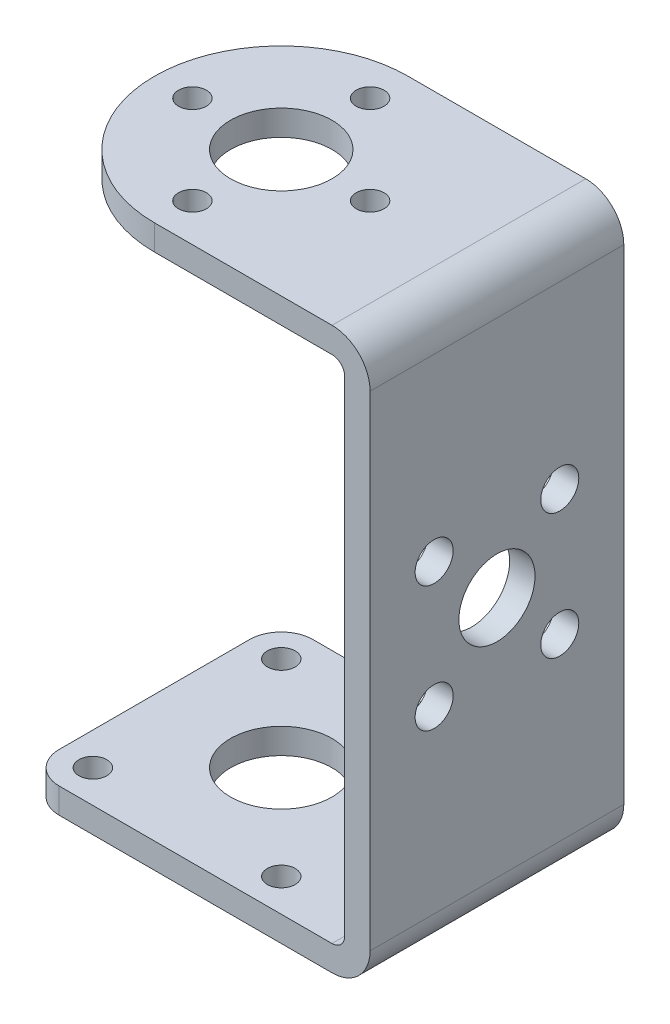
ISO-10303-21;
HEADER;
FILE_DESCRIPTION(('STEP AP214'),'2;1');
FILE_NAME('part.step','',(''),(''),'','','');
FILE_SCHEMA(('AUTOMOTIVE_DESIGN { 1 0 10303 214 1 1 1 1 }'));
ENDSEC;
DATA;
#1=APPLICATION_CONTEXT('core data for automotive mechanical design processes');
#2=APPLICATION_PROTOCOL_DEFINITION('international standard','automotive_design',2000,#1);
#3=PRODUCT_CONTEXT('',#1,'mechanical');
#4=PRODUCT('Part','Part','',(#3));
#5=PRODUCT_RELATED_PRODUCT_CATEGORY('part','',(#4));
#6=PRODUCT_DEFINITION_FORMATION('','',#4);
#7=PRODUCT_DEFINITION_CONTEXT('part definition',#1,'design');
#8=PRODUCT_DEFINITION('design','',#6,#7);
#9=PRODUCT_DEFINITION_SHAPE('','',#8);
#10=(LENGTH_UNIT() NAMED_UNIT(*) SI_UNIT(.MILLI.,.METRE.));
#11=(NAMED_UNIT(*) PLANE_ANGLE_UNIT() SI_UNIT($,.RADIAN.));
#12=(NAMED_UNIT(*) SI_UNIT($,.STERADIAN.) SOLID_ANGLE_UNIT());
#13=UNCERTAINTY_MEASURE_WITH_UNIT(LENGTH_MEASURE(1.E-05),#10,'distance_accuracy_value','');
#14=(GEOMETRIC_REPRESENTATION_CONTEXT(3) GLOBAL_UNCERTAINTY_ASSIGNED_CONTEXT((#13)) GLOBAL_UNIT_ASSIGNED_CONTEXT((#10,
#11,#12)) REPRESENTATION_CONTEXT('',''));
#15=CARTESIAN_POINT('',(0.,0.,0.));
#16=DIRECTION('',(0.,0.,1.));
#17=DIRECTION('',(1.,0.,0.));
#18=AXIS2_PLACEMENT_3D('',#15,#16,#17);
#19=CARTESIAN_POINT('',(7.424621202459,-22.1,-7.424621202459));
#20=DIRECTION('',(0.,-1.,0.));
#21=DIRECTION('',(0.,0.,-1.));
#22=AXIS2_PLACEMENT_3D('',#19,#20,#21);
#23=CYLINDRICAL_SURFACE('',#22,1.1);
#24=CARTESIAN_POINT('',(7.424621202459,-20.1,-7.424621202459));
#25=DIRECTION('',(0.,-1.,0.));
#26=DIRECTION('',(0.,0.,-1.));
#27=AXIS2_PLACEMENT_3D('',#24,#25,#26);
#28=CIRCLE('',#27,1.1);
#29=CARTESIAN_POINT('',(7.424621202459,-20.1,-8.524621202459));
#30=VERTEX_POINT('',#29);
#31=EDGE_CURVE('E241',#30,#30,#28,.T.);
#32=ORIENTED_EDGE('',*,*,#31,.F.);
#33=EDGE_LOOP('',(#32));
#34=FACE_BOUND('',#33,.T.);
#35=CARTESIAN_POINT('',(7.424621202459,-22.1,-7.424621202459));
#36=DIRECTION('',(0.,-1.,0.));
#37=DIRECTION('',(0.,0.,-1.));
#38=AXIS2_PLACEMENT_3D('',#35,#36,#37);
#39=CIRCLE('',#38,1.1);
#40=CARTESIAN_POINT('',(7.424621202459,-22.1,-8.524621202459));
#41=VERTEX_POINT('',#40);
#42=EDGE_CURVE('E131',#41,#41,#39,.F.);
#43=ORIENTED_EDGE('',*,*,#42,.F.);
#44=EDGE_LOOP('',(#43));
#45=FACE_BOUND('',#44,.T.);
#46=ADVANCED_FACE('F16',(#34,#45),#23,.F.);
#47=CARTESIAN_POINT('',(-7.424621202459,-22.1,-7.424621202459));
#48=DIRECTION('',(0.,-1.,0.));
#49=DIRECTION('',(0.,0.,-1.));
#50=AXIS2_PLACEMENT_3D('',#47,#48,#49);
#51=CYLINDRICAL_SURFACE('',#50,1.1);
#52=CARTESIAN_POINT('',(-7.424621202459,-20.1,-7.424621202459));
#53=DIRECTION('',(0.,-1.,0.));
#54=DIRECTION('',(0.,0.,-1.));
#55=AXIS2_PLACEMENT_3D('',#52,#53,#54);
#56=CIRCLE('',#55,1.1);
#57=CARTESIAN_POINT('',(-7.424621202459,-20.1,-8.524621202459));
#58=VERTEX_POINT('',#57);
#59=EDGE_CURVE('E238',#58,#58,#56,.T.);
#60=ORIENTED_EDGE('',*,*,#59,.F.);
#61=EDGE_LOOP('',(#60));
#62=FACE_BOUND('',#61,.T.);
#63=CARTESIAN_POINT('',(-7.424621202459,-22.1,-7.424621202459));
#64=DIRECTION('',(0.,-1.,0.));
#65=DIRECTION('',(0.,0.,-1.));
#66=AXIS2_PLACEMENT_3D('',#63,#64,#65);
#67=CIRCLE('',#66,1.1);
#68=CARTESIAN_POINT('',(-7.424621202459,-22.1,-8.524621202459));
#69=VERTEX_POINT('',#68);
#70=EDGE_CURVE('E274',#69,#69,#67,.F.);
#71=ORIENTED_EDGE('',*,*,#70,.F.);
#72=EDGE_LOOP('',(#71));
#73=FACE_BOUND('',#72,.T.);
#74=ADVANCED_FACE('F281',(#62,#73),#51,.F.);
#75=CARTESIAN_POINT('',(-7.424621202459,-22.1,7.424621202459));
#76=DIRECTION('',(0.,-1.,0.));
#77=DIRECTION('',(0.,0.,-1.));
#78=AXIS2_PLACEMENT_3D('',#75,#76,#77);
#79=CYLINDRICAL_SURFACE('',#78,1.1);
#80=CARTESIAN_POINT('',(-7.424621202459,-20.1,7.424621202459));
#81=DIRECTION('',(0.,-1.,0.));
#82=DIRECTION('',(0.,0.,-1.));
#83=AXIS2_PLACEMENT_3D('',#80,#81,#82);
#84=CIRCLE('',#83,1.1);
#85=CARTESIAN_POINT('',(-7.424621202459,-20.1,6.324621202459));
#86=VERTEX_POINT('',#85);
#87=EDGE_CURVE('E235',#86,#86,#84,.T.);
#88=ORIENTED_EDGE('',*,*,#87,.F.);
#89=EDGE_LOOP('',(#88));
#90=FACE_BOUND('',#89,.T.);
#91=CARTESIAN_POINT('',(-7.424621202459,-22.1,7.424621202459));
#92=DIRECTION('',(0.,-1.,0.));
#93=DIRECTION('',(0.,0.,-1.));
#94=AXIS2_PLACEMENT_3D('',#91,#92,#93);
#95=CIRCLE('',#94,1.1);
#96=CARTESIAN_POINT('',(-7.424621202459,-22.1,6.324621202459));
#97=VERTEX_POINT('',#96);
#98=EDGE_CURVE('E271',#97,#97,#95,.F.);
#99=ORIENTED_EDGE('',*,*,#98,.F.);
#100=EDGE_LOOP('',(#99));
#101=FACE_BOUND('',#100,.T.);
#102=ADVANCED_FACE('F287',(#90,#101),#79,.F.);
#103=CARTESIAN_POINT('',(7.424621202459,-22.1,7.424621202459));
#104=DIRECTION('',(0.,-1.,0.));
#105=DIRECTION('',(0.,0.,-1.));
#106=AXIS2_PLACEMENT_3D('',#103,#104,#105);
#107=CYLINDRICAL_SURFACE('',#106,1.1);
#108=CARTESIAN_POINT('',(7.424621202459,-20.1,7.424621202459));
#109=DIRECTION('',(0.,-1.,0.));
#110=DIRECTION('',(0.,0.,-1.));
#111=AXIS2_PLACEMENT_3D('',#108,#109,#110);
#112=CIRCLE('',#111,1.1);
#113=CARTESIAN_POINT('',(7.424621202459,-20.1,6.324621202459));
#114=VERTEX_POINT('',#113);
#115=EDGE_CURVE('E232',#114,#114,#112,.T.);
#116=ORIENTED_EDGE('',*,*,#115,.F.);
#117=EDGE_LOOP('',(#116));
#118=FACE_BOUND('',#117,.T.);
#119=CARTESIAN_POINT('',(7.424621202459,-22.1,7.424621202459));
#120=DIRECTION('',(0.,-1.,0.));
#121=DIRECTION('',(0.,0.,-1.));
#122=AXIS2_PLACEMENT_3D('',#119,#120,#121);
#123=CIRCLE('',#122,1.1);
#124=CARTESIAN_POINT('',(7.424621202459,-22.1,6.324621202459));
#125=VERTEX_POINT('',#124);
#126=EDGE_CURVE('E268',#125,#125,#123,.F.);
#127=ORIENTED_EDGE('',*,*,#126,.F.);
#128=EDGE_LOOP('',(#127));
#129=FACE_BOUND('',#128,.T.);
#130=ADVANCED_FACE('F395',(#118,#129),#107,.F.);
#131=CARTESIAN_POINT('',(0.,22.1,0.));
#132=DIRECTION('',(0.,1.,0.));
#133=DIRECTION('',(0.,0.,1.));
#134=AXIS2_PLACEMENT_3D('',#131,#132,#133);
#135=CYLINDRICAL_SURFACE('',#134,4.);
#136=CARTESIAN_POINT('',(0.,-20.1,0.));
#137=DIRECTION('',(0.,1.,0.));
#138=DIRECTION('',(0.,0.,1.));
#139=AXIS2_PLACEMENT_3D('',#136,#137,#138);
#140=CIRCLE('',#139,4.);
#141=CARTESIAN_POINT('',(0.,-20.1,4.));
#142=VERTEX_POINT('',#141);
#143=EDGE_CURVE('E229',#142,#142,#140,.F.);
#144=ORIENTED_EDGE('',*,*,#143,.F.);
#145=EDGE_LOOP('',(#144));
#146=FACE_BOUND('',#145,.T.);
#147=CARTESIAN_POINT('',(0.,-22.1,0.));
#148=DIRECTION('',(0.,1.,0.));
#149=DIRECTION('',(0.,0.,1.));
#150=AXIS2_PLACEMENT_3D('',#147,#148,#149);
#151=CIRCLE('',#150,4.);
#152=CARTESIAN_POINT('',(0.,-22.1,4.));
#153=VERTEX_POINT('',#152);
#154=EDGE_CURVE('E265',#153,#153,#151,.T.);
#155=ORIENTED_EDGE('',*,*,#154,.F.);
#156=EDGE_LOOP('',(#155));
#157=FACE_BOUND('',#156,.T.);
#158=ADVANCED_FACE('F392',(#146,#157),#135,.F.);
#159=CARTESIAN_POINT('',(-10.,-20.1,-10.));
#160=DIRECTION('',(-1.,0.,0.));
#161=DIRECTION('',(0.,0.,1.));
#162=AXIS2_PLACEMENT_3D('',#159,#160,#161);
#163=PLANE('',#162);
#164=DIRECTION('',(0.,0.,1.));
#165=VECTOR('',#164,1.);
#166=CARTESIAN_POINT('',(-10.,-20.1,-10.));
#167=LINE('',#166,#165);
#168=CARTESIAN_POINT('',(-10.,-20.1,-7.5));
#169=VERTEX_POINT('',#168);
#170=CARTESIAN_POINT('',(-10.,-20.1,7.5));
#171=VERTEX_POINT('',#170);
#172=EDGE_CURVE('E120',#169,#171,#167,.T.);
#173=ORIENTED_EDGE('',*,*,#172,.F.);
#174=DIRECTION('',(0.,1.,0.));
#175=VECTOR('',#174,1.);
#176=CARTESIAN_POINT('',(-10.,-79.71912,-7.5));
#177=LINE('',#176,#175);
#178=CARTESIAN_POINT('',(-10.,-22.1,-7.5));
#179=VERTEX_POINT('',#178);
#180=EDGE_CURVE('E113',#179,#169,#177,.T.);
#181=ORIENTED_EDGE('',*,*,#180,.F.);
#182=DIRECTION('',(0.,0.,-1.));
#183=VECTOR('',#182,1.);
#184=CARTESIAN_POINT('',(-10.,-22.1,-10.));
#185=LINE('',#184,#183);
#186=CARTESIAN_POINT('',(-10.,-22.1,7.5));
#187=VERTEX_POINT('',#186);
#188=EDGE_CURVE('E118',#187,#179,#185,.T.);
#189=ORIENTED_EDGE('',*,*,#188,.F.);
#190=DIRECTION('',(0.,-1.,0.));
#191=VECTOR('',#190,1.);
#192=CARTESIAN_POINT('',(-10.,79.71912,7.5));
#193=LINE('',#192,#191);
#194=EDGE_CURVE('E148',#171,#187,#193,.T.);
#195=ORIENTED_EDGE('',*,*,#194,.F.);
#196=EDGE_LOOP('',(#173,#181,#189,#195));
#197=FACE_BOUND('',#196,.T.);
#198=ADVANCED_FACE('F115',(#197),#163,.T.);
#199=CARTESIAN_POINT('',(0.,22.1,0.));
#200=DIRECTION('',(0.,1.,0.));
#201=DIRECTION('',(0.,0.,1.));
#202=AXIS2_PLACEMENT_3D('',#199,#200,#201);
#203=CYLINDRICAL_SURFACE('',#202,4.);
#204=CARTESIAN_POINT('',(0.,20.1,0.));
#205=DIRECTION('',(0.,1.,0.));
#206=DIRECTION('',(0.,0.,1.));
#207=AXIS2_PLACEMENT_3D('',#204,#205,#206);
#208=CIRCLE('',#207,4.);
#209=CARTESIAN_POINT('',(0.,20.1,4.));
#210=VERTEX_POINT('',#209);
#211=EDGE_CURVE('E220',#210,#210,#208,.T.);
#212=ORIENTED_EDGE('',*,*,#211,.F.);
#213=EDGE_LOOP('',(#212));
#214=FACE_BOUND('',#213,.T.);
#215=CARTESIAN_POINT('',(0.,22.1,0.));
#216=DIRECTION('',(0.,1.,0.));
#217=DIRECTION('',(0.,0.,1.));
#218=AXIS2_PLACEMENT_3D('',#215,#216,#217);
#219=CIRCLE('',#218,4.);
#220=CARTESIAN_POINT('',(0.,22.1,4.));
#221=VERTEX_POINT('',#220);
#222=EDGE_CURVE('E261',#221,#221,#219,.F.);
#223=ORIENTED_EDGE('',*,*,#222,.F.);
#224=EDGE_LOOP('',(#223));
#225=FACE_BOUND('',#224,.T.);
#226=ADVANCED_FACE('F385',(#214,#225),#203,.F.);
#227=CARTESIAN_POINT('',(0.,22.1,-7.));
#228=DIRECTION('',(0.,1.,0.));
#229=DIRECTION('',(0.,0.,1.));
#230=AXIS2_PLACEMENT_3D('',#227,#228,#229);
#231=CYLINDRICAL_SURFACE('',#230,1.1);
#232=CARTESIAN_POINT('',(0.,20.1,-7.));
#233=DIRECTION('',(0.,1.,0.));
#234=DIRECTION('',(0.,0.,1.));
#235=AXIS2_PLACEMENT_3D('',#232,#233,#234);
#236=CIRCLE('',#235,1.1);
#237=CARTESIAN_POINT('',(0.,20.1,-5.9));
#238=VERTEX_POINT('',#237);
#239=EDGE_CURVE('E217',#238,#238,#236,.T.);
#240=ORIENTED_EDGE('',*,*,#239,.F.);
#241=EDGE_LOOP('',(#240));
#242=FACE_BOUND('',#241,.T.);
#243=CARTESIAN_POINT('',(0.,22.1,-7.));
#244=DIRECTION('',(0.,1.,0.));
#245=DIRECTION('',(0.,0.,1.));
#246=AXIS2_PLACEMENT_3D('',#243,#244,#245);
#247=CIRCLE('',#246,1.1);
#248=CARTESIAN_POINT('',(0.,22.1,-5.9));
#249=VERTEX_POINT('',#248);
#250=EDGE_CURVE('E258',#249,#249,#247,.F.);
#251=ORIENTED_EDGE('',*,*,#250,.F.);
#252=EDGE_LOOP('',(#251));
#253=FACE_BOUND('',#252,.T.);
#254=ADVANCED_FACE('F381',(#242,#253),#231,.F.);
#255=CARTESIAN_POINT('',(-7.,22.1,0.));
#256=DIRECTION('',(0.,1.,0.));
#257=DIRECTION('',(0.,0.,1.));
#258=AXIS2_PLACEMENT_3D('',#255,#256,#257);
#259=CYLINDRICAL_SURFACE('',#258,1.1);
#260=CARTESIAN_POINT('',(-7.,20.1,0.));
#261=DIRECTION('',(0.,1.,0.));
#262=DIRECTION('',(0.,0.,1.));
#263=AXIS2_PLACEMENT_3D('',#260,#261,#262);
#264=CIRCLE('',#263,1.1);
#265=CARTESIAN_POINT('',(-7.,20.1,1.1));
#266=VERTEX_POINT('',#265);
#267=EDGE_CURVE('E214',#266,#266,#264,.T.);
#268=ORIENTED_EDGE('',*,*,#267,.F.);
#269=EDGE_LOOP('',(#268));
#270=FACE_BOUND('',#269,.T.);
#271=CARTESIAN_POINT('',(-7.,22.1,0.));
#272=DIRECTION('',(0.,1.,0.));
#273=DIRECTION('',(0.,0.,1.));
#274=AXIS2_PLACEMENT_3D('',#271,#272,#273);
#275=CIRCLE('',#274,1.1);
#276=CARTESIAN_POINT('',(-7.,22.1,1.1));
#277=VERTEX_POINT('',#276);
#278=EDGE_CURVE('E255',#277,#277,#275,.F.);
#279=ORIENTED_EDGE('',*,*,#278,.F.);
#280=EDGE_LOOP('',(#279));
#281=FACE_BOUND('',#280,.T.);
#282=ADVANCED_FACE('F377',(#270,#281),#259,.F.);
#283=CARTESIAN_POINT('',(0.,22.1,7.));
#284=DIRECTION('',(0.,1.,0.));
#285=DIRECTION('',(0.,0.,1.));
#286=AXIS2_PLACEMENT_3D('',#283,#284,#285);
#287=CYLINDRICAL_SURFACE('',#286,1.1);
#288=CARTESIAN_POINT('',(0.,20.1,7.));
#289=DIRECTION('',(0.,1.,0.));
#290=DIRECTION('',(0.,0.,1.));
#291=AXIS2_PLACEMENT_3D('',#288,#289,#290);
#292=CIRCLE('',#291,1.1);
#293=CARTESIAN_POINT('',(0.,20.1,8.1));
#294=VERTEX_POINT('',#293);
#295=EDGE_CURVE('E211',#294,#294,#292,.T.);
#296=ORIENTED_EDGE('',*,*,#295,.F.);
#297=EDGE_LOOP('',(#296));
#298=FACE_BOUND('',#297,.T.);
#299=CARTESIAN_POINT('',(0.,22.1,7.));
#300=DIRECTION('',(0.,1.,0.));
#301=DIRECTION('',(0.,0.,1.));
#302=AXIS2_PLACEMENT_3D('',#299,#300,#301);
#303=CIRCLE('',#302,1.1);
#304=CARTESIAN_POINT('',(0.,22.1,8.1));
#305=VERTEX_POINT('',#304);
#306=EDGE_CURVE('E252',#305,#305,#303,.F.);
#307=ORIENTED_EDGE('',*,*,#306,.F.);
#308=EDGE_LOOP('',(#307));
#309=FACE_BOUND('',#308,.T.);
#310=ADVANCED_FACE('F373',(#298,#309),#287,.F.);
#311=CARTESIAN_POINT('',(7.,22.1,0.));
#312=DIRECTION('',(0.,1.,0.));
#313=DIRECTION('',(0.,0.,1.));
#314=AXIS2_PLACEMENT_3D('',#311,#312,#313);
#315=CYLINDRICAL_SURFACE('',#314,1.1);
#316=CARTESIAN_POINT('',(7.,20.1,0.));
#317=DIRECTION('',(0.,1.,0.));
#318=DIRECTION('',(0.,0.,1.));
#319=AXIS2_PLACEMENT_3D('',#316,#317,#318);
#320=CIRCLE('',#319,1.1);
#321=CARTESIAN_POINT('',(7.,20.1,1.1));
#322=VERTEX_POINT('',#321);
#323=EDGE_CURVE('E207',#322,#322,#320,.T.);
#324=ORIENTED_EDGE('',*,*,#323,.F.);
#325=EDGE_LOOP('',(#324));
#326=FACE_BOUND('',#325,.T.);
#327=CARTESIAN_POINT('',(7.,22.1,0.));
#328=DIRECTION('',(0.,1.,0.));
#329=DIRECTION('',(0.,0.,1.));
#330=AXIS2_PLACEMENT_3D('',#327,#328,#329);
#331=CIRCLE('',#330,1.1);
#332=CARTESIAN_POINT('',(7.,22.1,1.1));
#333=VERTEX_POINT('',#332);
#334=EDGE_CURVE('E249',#333,#333,#331,.F.);
#335=ORIENTED_EDGE('',*,*,#334,.F.);
#336=EDGE_LOOP('',(#335));
#337=FACE_BOUND('',#336,.T.);
#338=ADVANCED_FACE('F370',(#326,#337),#315,.F.);
#339=CARTESIAN_POINT('',(-7.5,-79.71912,-7.5));
#340=DIRECTION('',(0.,1.,0.));
#341=DIRECTION('',(0.,0.,1.));
#342=AXIS2_PLACEMENT_3D('',#339,#340,#341);
#343=CYLINDRICAL_SURFACE('',#342,2.5);
#344=ORIENTED_EDGE('',*,*,#180,.T.);
#345=CARTESIAN_POINT('',(-7.5,-20.1,-7.5));
#346=DIRECTION('',(0.,1.,0.));
#347=DIRECTION('',(0.,0.,1.));
#348=AXIS2_PLACEMENT_3D('',#345,#346,#347);
#349=CIRCLE('',#348,2.5);
#350=CARTESIAN_POINT('',(-7.5,-20.1,-10.));
#351=VERTEX_POINT('',#350);
#352=EDGE_CURVE('E244',#351,#169,#349,.T.);
#353=ORIENTED_EDGE('',*,*,#352,.F.);
#354=DIRECTION('',(0.,1.,0.));
#355=VECTOR('',#354,1.);
#356=CARTESIAN_POINT('',(-7.5,0.,-10.));
#357=LINE('',#356,#355);
#358=CARTESIAN_POINT('',(-7.5,-22.1,-10.));
#359=VERTEX_POINT('',#358);
#360=EDGE_CURVE('E128',#351,#359,#357,.F.);
#361=ORIENTED_EDGE('',*,*,#360,.T.);
#362=CARTESIAN_POINT('',(-7.5,-22.1,-7.5));
#363=DIRECTION('',(0.,1.,0.));
#364=DIRECTION('',(0.,0.,1.));
#365=AXIS2_PLACEMENT_3D('',#362,#363,#364);
#366=CIRCLE('',#365,2.5);
#367=EDGE_CURVE('E19',#179,#359,#366,.F.);
#368=ORIENTED_EDGE('',*,*,#367,.F.);
#369=EDGE_LOOP('',(#344,#353,#361,#368));
#370=FACE_BOUND('',#369,.T.);
#371=ADVANCED_FACE('F126',(#370),#343,.T.);
#372=CARTESIAN_POINT('',(-10.,-22.1,-10.));
#373=DIRECTION('',(0.,-1.,0.));
#374=DIRECTION('',(0.,0.,-1.));
#375=AXIS2_PLACEMENT_3D('',#372,#373,#374);
#376=PLANE('',#375);
#377=ORIENTED_EDGE('',*,*,#154,.T.);
#378=EDGE_LOOP('',(#377));
#379=FACE_BOUND('',#378,.T.);
#380=ORIENTED_EDGE('',*,*,#126,.T.);
#381=EDGE_LOOP('',(#380));
#382=FACE_BOUND('',#381,.T.);
#383=ORIENTED_EDGE('',*,*,#98,.T.);
#384=EDGE_LOOP('',(#383));
#385=FACE_BOUND('',#384,.T.);
#386=ORIENTED_EDGE('',*,*,#70,.T.);
#387=EDGE_LOOP('',(#386));
#388=FACE_BOUND('',#387,.T.);
#389=ORIENTED_EDGE('',*,*,#42,.T.);
#390=EDGE_LOOP('',(#389));
#391=FACE_BOUND('',#390,.T.);
#392=ORIENTED_EDGE('',*,*,#188,.T.);
#393=ORIENTED_EDGE('',*,*,#367,.T.);
#394=DIRECTION('',(1.,0.,0.));
#395=VECTOR('',#394,1.);
#396=CARTESIAN_POINT('',(0.,-22.1,-10.));
#397=LINE('',#396,#395);
#398=CARTESIAN_POINT('',(14.,-22.1,-10.));
#399=VERTEX_POINT('',#398);
#400=EDGE_CURVE('E142',#359,#399,#397,.T.);
#401=ORIENTED_EDGE('',*,*,#400,.T.);
#402=DIRECTION('',(0.,0.,-1.));
#403=VECTOR('',#402,1.);
#404=CARTESIAN_POINT('',(14.,-22.1,36.072));
#405=LINE('',#404,#403);
#406=CARTESIAN_POINT('',(14.,-22.1,10.));
#407=VERTEX_POINT('',#406);
#408=EDGE_CURVE('E139',#407,#399,#405,.T.);
#409=ORIENTED_EDGE('',*,*,#408,.F.);
#410=DIRECTION('',(1.,0.,0.));
#411=VECTOR('',#410,1.);
#412=CARTESIAN_POINT('',(0.,-22.1,10.));
#413=LINE('',#412,#411);
#414=CARTESIAN_POINT('',(-7.5,-22.1,10.));
#415=VERTEX_POINT('',#414);
#416=EDGE_CURVE('E198',#415,#407,#413,.T.);
#417=ORIENTED_EDGE('',*,*,#416,.F.);
#418=CARTESIAN_POINT('',(-7.5,-22.1,7.5));
#419=DIRECTION('',(0.,-1.,0.));
#420=DIRECTION('',(0.,0.,-1.));
#421=AXIS2_PLACEMENT_3D('',#418,#419,#420);
#422=CIRCLE('',#421,2.5);
#423=EDGE_CURVE('E134',#187,#415,#422,.F.);
#424=ORIENTED_EDGE('',*,*,#423,.F.);
#425=EDGE_LOOP('',(#392,#393,#401,#409,#417,#424));
#426=FACE_BOUND('',#425,.T.);
#427=ADVANCED_FACE('F132',(#379,#382,#385,#388,#391,#426),#376,.T.);
#428=CARTESIAN_POINT('',(14.,-19.1,36.072));
#429=DIRECTION('',(0.,0.,-1.));
#430=DIRECTION('',(-1.,0.,0.));
#431=AXIS2_PLACEMENT_3D('',#428,#429,#430);
#432=CYLINDRICAL_SURFACE('',#431,3.);
#433=ORIENTED_EDGE('',*,*,#408,.T.);
#434=CARTESIAN_POINT('',(14.,-19.1,-10.));
#435=DIRECTION('',(0.,0.,-1.));
#436=DIRECTION('',(-1.,0.,0.));
#437=AXIS2_PLACEMENT_3D('',#434,#435,#436);
#438=CIRCLE('',#437,3.);
#439=CARTESIAN_POINT('',(17.,-19.1,-10.));
#440=VERTEX_POINT('',#439);
#441=EDGE_CURVE('E205',#399,#440,#438,.F.);
#442=ORIENTED_EDGE('',*,*,#441,.T.);
#443=DIRECTION('',(0.,0.,-1.));
#444=VECTOR('',#443,1.);
#445=CARTESIAN_POINT('',(17.,-19.1,-10.));
#446=LINE('',#445,#444);
#447=CARTESIAN_POINT('',(17.,-19.1,10.));
#448=VERTEX_POINT('',#447);
#449=EDGE_CURVE('E210',#448,#440,#446,.T.);
#450=ORIENTED_EDGE('',*,*,#449,.F.);
#451=CARTESIAN_POINT('',(14.,-19.1,10.));
#452=DIRECTION('',(0.,0.,-1.));
#453=DIRECTION('',(-1.,0.,0.));
#454=AXIS2_PLACEMENT_3D('',#451,#452,#453);
#455=CIRCLE('',#454,3.);
#456=EDGE_CURVE('E195',#407,#448,#455,.F.);
#457=ORIENTED_EDGE('',*,*,#456,.F.);
#458=EDGE_LOOP('',(#433,#442,#450,#457));
#459=FACE_BOUND('',#458,.T.);
#460=ADVANCED_FACE('F360',(#459),#432,.T.);
#461=CARTESIAN_POINT('',(14.,19.1,36.072));
#462=DIRECTION('',(0.,0.,-1.));
#463=DIRECTION('',(-1.,0.,0.));
#464=AXIS2_PLACEMENT_3D('',#461,#462,#463);
#465=CYLINDRICAL_SURFACE('',#464,3.);
#466=DIRECTION('',(0.,0.,-1.));
#467=VECTOR('',#466,1.);
#468=CARTESIAN_POINT('',(17.,19.1,-10.));
#469=LINE('',#468,#467);
#470=CARTESIAN_POINT('',(17.,19.1,-10.));
#471=VERTEX_POINT('',#470);
#472=CARTESIAN_POINT('',(17.,19.1,10.));
#473=VERTEX_POINT('',#472);
#474=EDGE_CURVE('E143',#471,#473,#469,.F.);
#475=ORIENTED_EDGE('',*,*,#474,.F.);
#476=CARTESIAN_POINT('',(14.,19.1,-10.));
#477=DIRECTION('',(0.,0.,-1.));
#478=DIRECTION('',(-1.,0.,0.));
#479=AXIS2_PLACEMENT_3D('',#476,#477,#478);
#480=CIRCLE('',#479,3.);
#481=CARTESIAN_POINT('',(14.,22.1,-10.));
#482=VERTEX_POINT('',#481);
#483=EDGE_CURVE('E202',#471,#482,#480,.F.);
#484=ORIENTED_EDGE('',*,*,#483,.T.);
#485=DIRECTION('',(0.,0.,1.));
#486=VECTOR('',#485,1.);
#487=CARTESIAN_POINT('',(14.,22.1,-10.));
#488=LINE('',#487,#486);
#489=CARTESIAN_POINT('',(14.,22.1,10.));
#490=VERTEX_POINT('',#489);
#491=EDGE_CURVE('E264',#490,#482,#488,.F.);
#492=ORIENTED_EDGE('',*,*,#491,.F.);
#493=CARTESIAN_POINT('',(14.,19.1,10.));
#494=DIRECTION('',(0.,0.,-1.));
#495=DIRECTION('',(-1.,0.,0.));
#496=AXIS2_PLACEMENT_3D('',#493,#494,#495);
#497=CIRCLE('',#496,3.);
#498=EDGE_CURVE('E190',#473,#490,#497,.F.);
#499=ORIENTED_EDGE('',*,*,#498,.F.);
#500=EDGE_LOOP('',(#475,#484,#492,#499));
#501=FACE_BOUND('',#500,.T.);
#502=ADVANCED_FACE('F356',(#501),#465,.T.);
#503=CARTESIAN_POINT('',(17.,22.1,-10.));
#504=DIRECTION('',(0.,1.,0.));
#505=DIRECTION('',(0.,0.,1.));
#506=AXIS2_PLACEMENT_3D('',#503,#504,#505);
#507=PLANE('',#506);
#508=ORIENTED_EDGE('',*,*,#334,.T.);
#509=EDGE_LOOP('',(#508));
#510=FACE_BOUND('',#509,.T.);
#511=ORIENTED_EDGE('',*,*,#306,.T.);
#512=EDGE_LOOP('',(#511));
#513=FACE_BOUND('',#512,.T.);
#514=ORIENTED_EDGE('',*,*,#278,.T.);
#515=EDGE_LOOP('',(#514));
#516=FACE_BOUND('',#515,.T.);
#517=ORIENTED_EDGE('',*,*,#250,.T.);
#518=EDGE_LOOP('',(#517));
#519=FACE_BOUND('',#518,.T.);
#520=ORIENTED_EDGE('',*,*,#222,.T.);
#521=EDGE_LOOP('',(#520));
#522=FACE_BOUND('',#521,.T.);
#523=DIRECTION('',(1.,0.,0.));
#524=VECTOR('',#523,1.);
#525=CARTESIAN_POINT('',(0.,22.1,-10.));
#526=LINE('',#525,#524);
#527=CARTESIAN_POINT('',(0.,22.1,-10.));
#528=VERTEX_POINT('',#527);
#529=EDGE_CURVE('E147',#482,#528,#526,.F.);
#530=ORIENTED_EDGE('',*,*,#529,.T.);
#531=CARTESIAN_POINT('',(0.,22.1,0.));
#532=DIRECTION('',(0.,-1.,0.));
#533=DIRECTION('',(0.,0.,-1.));
#534=AXIS2_PLACEMENT_3D('',#531,#532,#533);
#535=CIRCLE('',#534,10.);
#536=CARTESIAN_POINT('',(0.,22.1,10.));
#537=VERTEX_POINT('',#536);
#538=EDGE_CURVE('E246',#537,#528,#535,.T.);
#539=ORIENTED_EDGE('',*,*,#538,.F.);
#540=DIRECTION('',(1.,0.,0.));
#541=VECTOR('',#540,1.);
#542=CARTESIAN_POINT('',(0.,22.1,10.));
#543=LINE('',#542,#541);
#544=EDGE_CURVE('E193',#490,#537,#543,.F.);
#545=ORIENTED_EDGE('',*,*,#544,.F.);
#546=ORIENTED_EDGE('',*,*,#491,.T.);
#547=EDGE_LOOP('',(#530,#539,#545,#546));
#548=FACE_BOUND('',#547,.T.);
#549=ADVANCED_FACE('F352',(#510,#513,#516,#519,#522,#548),#507,.T.);
#550=CARTESIAN_POINT('',(0.,79.71912,0.));
#551=DIRECTION('',(0.,-1.,0.));
#552=DIRECTION('',(0.,0.,-1.));
#553=AXIS2_PLACEMENT_3D('',#550,#551,#552);
#554=CYLINDRICAL_SURFACE('',#553,10.);
#555=DIRECTION('',(0.,1.,0.));
#556=VECTOR('',#555,1.);
#557=CARTESIAN_POINT('',(0.,0.,-10.));
#558=LINE('',#557,#556);
#559=CARTESIAN_POINT('',(0.,20.1,-10.));
#560=VERTEX_POINT('',#559);
#561=EDGE_CURVE('E144',#528,#560,#558,.F.);
#562=ORIENTED_EDGE('',*,*,#561,.T.);
#563=CARTESIAN_POINT('',(0.,20.1,0.));
#564=DIRECTION('',(0.,-1.,0.));
#565=DIRECTION('',(0.,0.,-1.));
#566=AXIS2_PLACEMENT_3D('',#563,#564,#565);
#567=CIRCLE('',#566,10.);
#568=CARTESIAN_POINT('',(0.,20.1,10.));
#569=VERTEX_POINT('',#568);
#570=EDGE_CURVE('E223',#569,#560,#567,.T.);
#571=ORIENTED_EDGE('',*,*,#570,.F.);
#572=DIRECTION('',(0.,1.,0.));
#573=VECTOR('',#572,1.);
#574=CARTESIAN_POINT('',(0.,0.,10.));
#575=LINE('',#574,#573);
#576=EDGE_CURVE('E435',#537,#569,#575,.F.);
#577=ORIENTED_EDGE('',*,*,#576,.F.);
#578=ORIENTED_EDGE('',*,*,#538,.T.);
#579=EDGE_LOOP('',(#562,#571,#577,#578));
#580=FACE_BOUND('',#579,.T.);
#581=ADVANCED_FACE('F348',(#580),#554,.T.);
#582=CARTESIAN_POINT('',(15.,-20.1,-10.));
#583=DIRECTION('',(0.,1.,0.));
#584=DIRECTION('',(0.,0.,1.));
#585=AXIS2_PLACEMENT_3D('',#582,#583,#584);
#586=PLANE('',#585);
#587=ORIENTED_EDGE('',*,*,#143,.T.);
#588=EDGE_LOOP('',(#587));
#589=FACE_BOUND('',#588,.T.);
#590=ORIENTED_EDGE('',*,*,#115,.T.);
#591=EDGE_LOOP('',(#590));
#592=FACE_BOUND('',#591,.T.);
#593=ORIENTED_EDGE('',*,*,#87,.T.);
#594=EDGE_LOOP('',(#593));
#595=FACE_BOUND('',#594,.T.);
#596=ORIENTED_EDGE('',*,*,#59,.T.);
#597=EDGE_LOOP('',(#596));
#598=FACE_BOUND('',#597,.T.);
#599=ORIENTED_EDGE('',*,*,#31,.T.);
#600=EDGE_LOOP('',(#599));
#601=FACE_BOUND('',#600,.T.);
#602=DIRECTION('',(1.,0.,0.));
#603=VECTOR('',#602,1.);
#604=CARTESIAN_POINT('',(0.,-20.1,-10.));
#605=LINE('',#604,#603);
#606=CARTESIAN_POINT('',(14.,-20.1,-10.));
#607=VERTEX_POINT('',#606);
#608=EDGE_CURVE('E418',#607,#351,#605,.F.);
#609=ORIENTED_EDGE('',*,*,#608,.T.);
#610=ORIENTED_EDGE('',*,*,#352,.T.);
#611=ORIENTED_EDGE('',*,*,#172,.T.);
#612=CARTESIAN_POINT('',(-7.5,-20.1,7.5));
#613=DIRECTION('',(0.,-1.,0.));
#614=DIRECTION('',(0.,0.,-1.));
#615=AXIS2_PLACEMENT_3D('',#612,#613,#614);
#616=CIRCLE('',#615,2.5);
#617=CARTESIAN_POINT('',(-7.5,-20.1,10.));
#618=VERTEX_POINT('',#617);
#619=EDGE_CURVE('E149',#618,#171,#616,.T.);
#620=ORIENTED_EDGE('',*,*,#619,.F.);
#621=DIRECTION('',(1.,0.,0.));
#622=VECTOR('',#621,1.);
#623=CARTESIAN_POINT('',(0.,-20.1,10.));
#624=LINE('',#623,#622);
#625=CARTESIAN_POINT('',(14.,-20.1,10.));
#626=VERTEX_POINT('',#625);
#627=EDGE_CURVE('E188',#626,#618,#624,.F.);
#628=ORIENTED_EDGE('',*,*,#627,.F.);
#629=DIRECTION('',(0.,0.,1.));
#630=VECTOR('',#629,1.);
#631=CARTESIAN_POINT('',(14.,-20.1,-36.072));
#632=LINE('',#631,#630);
#633=EDGE_CURVE('E201',#626,#607,#632,.F.);
#634=ORIENTED_EDGE('',*,*,#633,.T.);
#635=EDGE_LOOP('',(#609,#610,#611,#620,#628,#634));
#636=FACE_BOUND('',#635,.T.);
#637=ADVANCED_FACE('F344',(#589,#592,#595,#598,#601,#636),#586,.T.);
#638=CARTESIAN_POINT('',(-7.5,79.71912,7.5));
#639=DIRECTION('',(0.,-1.,0.));
#640=DIRECTION('',(0.,0.,-1.));
#641=AXIS2_PLACEMENT_3D('',#638,#639,#640);
#642=CYLINDRICAL_SURFACE('',#641,2.5);
#643=ORIENTED_EDGE('',*,*,#194,.T.);
#644=ORIENTED_EDGE('',*,*,#423,.T.);
#645=DIRECTION('',(0.,1.,0.));
#646=VECTOR('',#645,1.);
#647=CARTESIAN_POINT('',(-7.5,0.,10.));
#648=LINE('',#647,#646);
#649=EDGE_CURVE('E184',#618,#415,#648,.F.);
#650=ORIENTED_EDGE('',*,*,#649,.F.);
#651=ORIENTED_EDGE('',*,*,#619,.T.);
#652=EDGE_LOOP('',(#643,#644,#650,#651));
#653=FACE_BOUND('',#652,.T.);
#654=ADVANCED_FACE('F340',(#653),#642,.T.);
#655=CARTESIAN_POINT('',(-10.,20.1,-10.));
#656=DIRECTION('',(0.,-1.,0.));
#657=DIRECTION('',(0.,0.,-1.));
#658=AXIS2_PLACEMENT_3D('',#655,#656,#657);
#659=PLANE('',#658);
#660=ORIENTED_EDGE('',*,*,#323,.T.);
#661=EDGE_LOOP('',(#660));
#662=FACE_BOUND('',#661,.T.);
#663=ORIENTED_EDGE('',*,*,#295,.T.);
#664=EDGE_LOOP('',(#663));
#665=FACE_BOUND('',#664,.T.);
#666=ORIENTED_EDGE('',*,*,#267,.T.);
#667=EDGE_LOOP('',(#666));
#668=FACE_BOUND('',#667,.T.);
#669=ORIENTED_EDGE('',*,*,#239,.T.);
#670=EDGE_LOOP('',(#669));
#671=FACE_BOUND('',#670,.T.);
#672=ORIENTED_EDGE('',*,*,#211,.T.);
#673=EDGE_LOOP('',(#672));
#674=FACE_BOUND('',#673,.T.);
#675=DIRECTION('',(1.,0.,0.));
#676=VECTOR('',#675,1.);
#677=CARTESIAN_POINT('',(0.,20.1,10.));
#678=LINE('',#677,#676);
#679=CARTESIAN_POINT('',(14.,20.1,10.));
#680=VERTEX_POINT('',#679);
#681=EDGE_CURVE('E189',#569,#680,#678,.T.);
#682=ORIENTED_EDGE('',*,*,#681,.F.);
#683=ORIENTED_EDGE('',*,*,#570,.T.);
#684=DIRECTION('',(1.,0.,0.));
#685=VECTOR('',#684,1.);
#686=CARTESIAN_POINT('',(0.,20.1,-10.));
#687=LINE('',#686,#685);
#688=CARTESIAN_POINT('',(14.,20.1,-10.));
#689=VERTEX_POINT('',#688);
#690=EDGE_CURVE('E146',#560,#689,#687,.T.);
#691=ORIENTED_EDGE('',*,*,#690,.T.);
#692=DIRECTION('',(0.,0.,1.));
#693=VECTOR('',#692,1.);
#694=CARTESIAN_POINT('',(14.,20.1,-36.072));
#695=LINE('',#694,#693);
#696=EDGE_CURVE('E180',#689,#680,#695,.T.);
#697=ORIENTED_EDGE('',*,*,#696,.T.);
#698=EDGE_LOOP('',(#682,#683,#691,#697));
#699=FACE_BOUND('',#698,.T.);
#700=ADVANCED_FACE('F336',(#662,#665,#668,#671,#674,#699),#659,.T.);
#701=CARTESIAN_POINT('',(17.,-22.1,-10.));
#702=DIRECTION('',(1.,0.,0.));
#703=DIRECTION('',(0.,0.,-1.));
#704=AXIS2_PLACEMENT_3D('',#701,#702,#703);
#705=PLANE('',#704);
#706=CARTESIAN_POINT('',(17.,4.949747468306,-4.949747468306));
#707=DIRECTION('',(1.,0.,0.));
#708=DIRECTION('',(0.,0.,-1.));
#709=AXIS2_PLACEMENT_3D('',#706,#707,#708);
#710=CIRCLE('',#709,1.5);
#711=CARTESIAN_POINT('',(17.,4.949747468306,-6.449747468306));
#712=VERTEX_POINT('',#711);
#713=EDGE_CURVE('E163',#712,#712,#710,.F.);
#714=ORIENTED_EDGE('',*,*,#713,.T.);
#715=EDGE_LOOP('',(#714));
#716=FACE_BOUND('',#715,.T.);
#717=CARTESIAN_POINT('',(17.,-4.949747468306,-4.949747468306));
#718=DIRECTION('',(1.,0.,0.));
#719=DIRECTION('',(0.,0.,-1.));
#720=AXIS2_PLACEMENT_3D('',#717,#718,#719);
#721=CIRCLE('',#720,1.5);
#722=CARTESIAN_POINT('',(17.,-4.949747468306,-6.449747468306));
#723=VERTEX_POINT('',#722);
#724=EDGE_CURVE('E167',#723,#723,#721,.F.);
#725=ORIENTED_EDGE('',*,*,#724,.T.);
#726=EDGE_LOOP('',(#725));
#727=FACE_BOUND('',#726,.T.);
#728=CARTESIAN_POINT('',(17.,-4.949747468306,4.949747468306));
#729=DIRECTION('',(1.,0.,0.));
#730=DIRECTION('',(0.,0.,-1.));
#731=AXIS2_PLACEMENT_3D('',#728,#729,#730);
#732=CIRCLE('',#731,1.5);
#733=CARTESIAN_POINT('',(17.,-4.949747468306,3.449747468306));
#734=VERTEX_POINT('',#733);
#735=EDGE_CURVE('E170',#734,#734,#732,.F.);
#736=ORIENTED_EDGE('',*,*,#735,.T.);
#737=EDGE_LOOP('',(#736));
#738=FACE_BOUND('',#737,.T.);
#739=CARTESIAN_POINT('',(17.,4.949747468306,4.949747468306));
#740=DIRECTION('',(1.,0.,0.));
#741=DIRECTION('',(0.,0.,-1.));
#742=AXIS2_PLACEMENT_3D('',#739,#740,#741);
#743=CIRCLE('',#742,1.5);
#744=CARTESIAN_POINT('',(17.,4.949747468306,3.449747468306));
#745=VERTEX_POINT('',#744);
#746=EDGE_CURVE('E173',#745,#745,#743,.F.);
#747=ORIENTED_EDGE('',*,*,#746,.T.);
#748=EDGE_LOOP('',(#747));
#749=FACE_BOUND('',#748,.T.);
#750=CARTESIAN_POINT('',(17.,0.,0.));
#751=DIRECTION('',(1.,0.,0.));
#752=DIRECTION('',(0.,0.,-1.));
#753=AXIS2_PLACEMENT_3D('',#750,#751,#752);
#754=CIRCLE('',#753,3.);
#755=CARTESIAN_POINT('',(17.,0.,-3.));
#756=VERTEX_POINT('',#755);
#757=EDGE_CURVE('E176',#756,#756,#754,.F.);
#758=ORIENTED_EDGE('',*,*,#757,.T.);
#759=EDGE_LOOP('',(#758));
#760=FACE_BOUND('',#759,.T.);
#761=DIRECTION('',(0.,1.,0.));
#762=VECTOR('',#761,1.);
#763=CARTESIAN_POINT('',(17.,0.,-10.));
#764=LINE('',#763,#762);
#765=EDGE_CURVE('E204',#440,#471,#764,.T.);
#766=ORIENTED_EDGE('',*,*,#765,.T.);
#767=ORIENTED_EDGE('',*,*,#474,.T.);
#768=DIRECTION('',(0.,1.,0.));
#769=VECTOR('',#768,1.);
#770=CARTESIAN_POINT('',(17.,0.,10.));
#771=LINE('',#770,#769);
#772=EDGE_CURVE('E194',#448,#473,#771,.T.);
#773=ORIENTED_EDGE('',*,*,#772,.F.);
#774=ORIENTED_EDGE('',*,*,#449,.T.);
#775=EDGE_LOOP('',(#766,#767,#773,#774));
#776=FACE_BOUND('',#775,.T.);
#777=ADVANCED_FACE('F332',(#716,#727,#738,#749,#760,#776),#705,.T.);
#778=CARTESIAN_POINT('',(0.,0.,-10.));
#779=DIRECTION('',(0.,0.,1.));
#780=DIRECTION('',(1.,0.,0.));
#781=AXIS2_PLACEMENT_3D('',#778,#779,#780);
#782=PLANE('',#781);
#783=CARTESIAN_POINT('',(14.,-19.1,-10.));
#784=DIRECTION('',(0.,0.,1.));
#785=DIRECTION('',(1.,0.,0.));
#786=AXIS2_PLACEMENT_3D('',#783,#784,#785);
#787=CIRCLE('',#786,1.);
#788=CARTESIAN_POINT('',(15.,-19.1,-10.));
#789=VERTEX_POINT('',#788);
#790=EDGE_CURVE('E199',#607,#789,#787,.T.);
#791=ORIENTED_EDGE('',*,*,#790,.T.);
#792=DIRECTION('',(0.,1.,0.));
#793=VECTOR('',#792,1.);
#794=CARTESIAN_POINT('',(15.,20.1,-10.));
#795=LINE('',#794,#793);
#796=CARTESIAN_POINT('',(15.,19.1,-10.));
#797=VERTEX_POINT('',#796);
#798=EDGE_CURVE('E166',#797,#789,#795,.F.);
#799=ORIENTED_EDGE('',*,*,#798,.F.);
#800=CARTESIAN_POINT('',(14.,19.1,-10.));
#801=DIRECTION('',(0.,0.,1.));
#802=DIRECTION('',(1.,0.,0.));
#803=AXIS2_PLACEMENT_3D('',#800,#801,#802);
#804=CIRCLE('',#803,1.);
#805=EDGE_CURVE('E181',#797,#689,#804,.T.);
#806=ORIENTED_EDGE('',*,*,#805,.T.);
#807=ORIENTED_EDGE('',*,*,#690,.F.);
#808=ORIENTED_EDGE('',*,*,#561,.F.);
#809=ORIENTED_EDGE('',*,*,#529,.F.);
#810=ORIENTED_EDGE('',*,*,#483,.F.);
#811=ORIENTED_EDGE('',*,*,#765,.F.);
#812=ORIENTED_EDGE('',*,*,#441,.F.);
#813=ORIENTED_EDGE('',*,*,#400,.F.);
#814=ORIENTED_EDGE('',*,*,#360,.F.);
#815=ORIENTED_EDGE('',*,*,#608,.F.);
#816=EDGE_LOOP('',(#791,#799,#806,#807,#808,#809,#810,#811,#812,#813,#814,#815));
#817=FACE_BOUND('',#816,.T.);
#818=ADVANCED_FACE('F328',(#817),#782,.F.);
#819=CARTESIAN_POINT('',(14.,-19.1,-36.072));
#820=DIRECTION('',(0.,0.,1.));
#821=DIRECTION('',(1.,0.,0.));
#822=AXIS2_PLACEMENT_3D('',#819,#820,#821);
#823=CYLINDRICAL_SURFACE('',#822,1.);
#824=DIRECTION('',(0.,0.,1.));
#825=VECTOR('',#824,1.);
#826=CARTESIAN_POINT('',(15.,-19.1,-10.));
#827=LINE('',#826,#825);
#828=CARTESIAN_POINT('',(15.,-19.1,10.));
#829=VERTEX_POINT('',#828);
#830=EDGE_CURVE('E457',#789,#829,#827,.T.);
#831=ORIENTED_EDGE('',*,*,#830,.F.);
#832=ORIENTED_EDGE('',*,*,#790,.F.);
#833=ORIENTED_EDGE('',*,*,#633,.F.);
#834=CARTESIAN_POINT('',(14.,-19.1,10.));
#835=DIRECTION('',(0.,0.,1.));
#836=DIRECTION('',(1.,0.,0.));
#837=AXIS2_PLACEMENT_3D('',#834,#835,#836);
#838=CIRCLE('',#837,1.);
#839=EDGE_CURVE('E185',#829,#626,#838,.F.);
#840=ORIENTED_EDGE('',*,*,#839,.F.);
#841=EDGE_LOOP('',(#831,#832,#833,#840));
#842=FACE_BOUND('',#841,.T.);
#843=ADVANCED_FACE('F325',(#842),#823,.F.);
#844=CARTESIAN_POINT('',(0.,0.,10.));
#845=DIRECTION('',(0.,0.,1.));
#846=DIRECTION('',(1.,0.,0.));
#847=AXIS2_PLACEMENT_3D('',#844,#845,#846);
#848=PLANE('',#847);
#849=ORIENTED_EDGE('',*,*,#627,.T.);
#850=ORIENTED_EDGE('',*,*,#649,.T.);
#851=ORIENTED_EDGE('',*,*,#416,.T.);
#852=ORIENTED_EDGE('',*,*,#456,.T.);
#853=ORIENTED_EDGE('',*,*,#772,.T.);
#854=ORIENTED_EDGE('',*,*,#498,.T.);
#855=ORIENTED_EDGE('',*,*,#544,.T.);
#856=ORIENTED_EDGE('',*,*,#576,.T.);
#857=ORIENTED_EDGE('',*,*,#681,.T.);
#858=CARTESIAN_POINT('',(14.,19.1,10.));
#859=DIRECTION('',(0.,0.,1.));
#860=DIRECTION('',(1.,0.,0.));
#861=AXIS2_PLACEMENT_3D('',#858,#859,#860);
#862=CIRCLE('',#861,1.);
#863=CARTESIAN_POINT('',(15.,19.1,10.));
#864=VERTEX_POINT('',#863);
#865=EDGE_CURVE('E34',#680,#864,#862,.F.);
#866=ORIENTED_EDGE('',*,*,#865,.T.);
#867=DIRECTION('',(0.,1.,0.));
#868=VECTOR('',#867,1.);
#869=CARTESIAN_POINT('',(15.,20.1,10.));
#870=LINE('',#869,#868);
#871=EDGE_CURVE('E460',#829,#864,#870,.T.);
#872=ORIENTED_EDGE('',*,*,#871,.F.);
#873=ORIENTED_EDGE('',*,*,#839,.T.);
#874=EDGE_LOOP('',(#849,#850,#851,#852,#853,#854,#855,#856,#857,#866,#872,#873));
#875=FACE_BOUND('',#874,.T.);
#876=ADVANCED_FACE('F321',(#875),#848,.T.);
#877=CARTESIAN_POINT('',(14.,19.1,-36.072));
#878=DIRECTION('',(0.,0.,1.));
#879=DIRECTION('',(1.,0.,0.));
#880=AXIS2_PLACEMENT_3D('',#877,#878,#879);
#881=CYLINDRICAL_SURFACE('',#880,1.);
#882=ORIENTED_EDGE('',*,*,#696,.F.);
#883=ORIENTED_EDGE('',*,*,#805,.F.);
#884=DIRECTION('',(0.,0.,1.));
#885=VECTOR('',#884,1.);
#886=CARTESIAN_POINT('',(15.,19.1,-10.));
#887=LINE('',#886,#885);
#888=EDGE_CURVE('E162',#864,#797,#887,.F.);
#889=ORIENTED_EDGE('',*,*,#888,.F.);
#890=ORIENTED_EDGE('',*,*,#865,.F.);
#891=EDGE_LOOP('',(#882,#883,#889,#890));
#892=FACE_BOUND('',#891,.T.);
#893=ADVANCED_FACE('F317',(#892),#881,.F.);
#894=CARTESIAN_POINT('',(17.,0.,0.));
#895=DIRECTION('',(1.,0.,0.));
#896=DIRECTION('',(0.,0.,-1.));
#897=AXIS2_PLACEMENT_3D('',#894,#895,#896);
#898=CYLINDRICAL_SURFACE('',#897,3.);
#899=CARTESIAN_POINT('',(15.,0.,0.));
#900=DIRECTION('',(1.,0.,0.));
#901=DIRECTION('',(0.,0.,-1.));
#902=AXIS2_PLACEMENT_3D('',#899,#900,#901);
#903=CIRCLE('',#902,3.);
#904=CARTESIAN_POINT('',(15.,0.,-3.));
#905=VERTEX_POINT('',#904);
#906=EDGE_CURVE('E159',#905,#905,#903,.T.);
#907=ORIENTED_EDGE('',*,*,#906,.F.);
#908=EDGE_LOOP('',(#907));
#909=FACE_BOUND('',#908,.T.);
#910=ORIENTED_EDGE('',*,*,#757,.F.);
#911=EDGE_LOOP('',(#910));
#912=FACE_BOUND('',#911,.T.);
#913=ADVANCED_FACE('F313',(#909,#912),#898,.F.);
#914=CARTESIAN_POINT('',(17.,4.949747468306,4.949747468306));
#915=DIRECTION('',(1.,0.,0.));
#916=DIRECTION('',(0.,0.,-1.));
#917=AXIS2_PLACEMENT_3D('',#914,#915,#916);
#918=CYLINDRICAL_SURFACE('',#917,1.5);
#919=CARTESIAN_POINT('',(15.,4.949747468306,4.949747468306));
#920=DIRECTION('',(1.,0.,0.));
#921=DIRECTION('',(0.,0.,-1.));
#922=AXIS2_PLACEMENT_3D('',#919,#920,#921);
#923=CIRCLE('',#922,1.5);
#924=CARTESIAN_POINT('',(15.,4.949747468306,3.449747468306));
#925=VERTEX_POINT('',#924);
#926=EDGE_CURVE('E156',#925,#925,#923,.T.);
#927=ORIENTED_EDGE('',*,*,#926,.F.);
#928=EDGE_LOOP('',(#927));
#929=FACE_BOUND('',#928,.T.);
#930=ORIENTED_EDGE('',*,*,#746,.F.);
#931=EDGE_LOOP('',(#930));
#932=FACE_BOUND('',#931,.T.);
#933=ADVANCED_FACE('F309',(#929,#932),#918,.F.);
#934=CARTESIAN_POINT('',(17.,-4.949747468306,4.949747468306));
#935=DIRECTION('',(1.,0.,0.));
#936=DIRECTION('',(0.,0.,-1.));
#937=AXIS2_PLACEMENT_3D('',#934,#935,#936);
#938=CYLINDRICAL_SURFACE('',#937,1.5);
#939=CARTESIAN_POINT('',(15.,-4.949747468306,4.949747468306));
#940=DIRECTION('',(1.,0.,0.));
#941=DIRECTION('',(0.,0.,-1.));
#942=AXIS2_PLACEMENT_3D('',#939,#940,#941);
#943=CIRCLE('',#942,1.5);
#944=CARTESIAN_POINT('',(15.,-4.949747468306,3.449747468306));
#945=VERTEX_POINT('',#944);
#946=EDGE_CURVE('E153',#945,#945,#943,.T.);
#947=ORIENTED_EDGE('',*,*,#946,.F.);
#948=EDGE_LOOP('',(#947));
#949=FACE_BOUND('',#948,.T.);
#950=ORIENTED_EDGE('',*,*,#735,.F.);
#951=EDGE_LOOP('',(#950));
#952=FACE_BOUND('',#951,.T.);
#953=ADVANCED_FACE('F305',(#949,#952),#938,.F.);
#954=CARTESIAN_POINT('',(17.,-4.949747468306,-4.949747468306));
#955=DIRECTION('',(1.,0.,0.));
#956=DIRECTION('',(0.,0.,-1.));
#957=AXIS2_PLACEMENT_3D('',#954,#955,#956);
#958=CYLINDRICAL_SURFACE('',#957,1.5);
#959=CARTESIAN_POINT('',(15.,-4.949747468306,-4.949747468306));
#960=DIRECTION('',(1.,0.,0.));
#961=DIRECTION('',(0.,0.,-1.));
#962=AXIS2_PLACEMENT_3D('',#959,#960,#961);
#963=CIRCLE('',#962,1.5);
#964=CARTESIAN_POINT('',(15.,-4.949747468306,-6.449747468306));
#965=VERTEX_POINT('',#964);
#966=EDGE_CURVE('E25',#965,#965,#963,.T.);
#967=ORIENTED_EDGE('',*,*,#966,.F.);
#968=EDGE_LOOP('',(#967));
#969=FACE_BOUND('',#968,.T.);
#970=ORIENTED_EDGE('',*,*,#724,.F.);
#971=EDGE_LOOP('',(#970));
#972=FACE_BOUND('',#971,.T.);
#973=ADVANCED_FACE('F298',(#969,#972),#958,.F.);
#974=CARTESIAN_POINT('',(17.,4.949747468306,-4.949747468306));
#975=DIRECTION('',(1.,0.,0.));
#976=DIRECTION('',(0.,0.,-1.));
#977=AXIS2_PLACEMENT_3D('',#974,#975,#976);
#978=CYLINDRICAL_SURFACE('',#977,1.5);
#979=CARTESIAN_POINT('',(15.,4.949747468306,-4.949747468306));
#980=DIRECTION('',(1.,0.,0.));
#981=DIRECTION('',(0.,0.,-1.));
#982=AXIS2_PLACEMENT_3D('',#979,#980,#981);
#983=CIRCLE('',#982,1.5);
#984=CARTESIAN_POINT('',(15.,4.949747468306,-6.449747468306));
#985=VERTEX_POINT('',#984);
#986=EDGE_CURVE('E11',#985,#985,#983,.T.);
#987=ORIENTED_EDGE('',*,*,#986,.F.);
#988=EDGE_LOOP('',(#987));
#989=FACE_BOUND('',#988,.T.);
#990=ORIENTED_EDGE('',*,*,#713,.F.);
#991=EDGE_LOOP('',(#990));
#992=FACE_BOUND('',#991,.T.);
#993=ADVANCED_FACE('F292',(#989,#992),#978,.F.);
#994=CARTESIAN_POINT('',(15.,20.1,-10.));
#995=DIRECTION('',(-1.,0.,0.));
#996=DIRECTION('',(0.,0.,1.));
#997=AXIS2_PLACEMENT_3D('',#994,#995,#996);
#998=PLANE('',#997);
#999=ORIENTED_EDGE('',*,*,#986,.T.);
#1000=EDGE_LOOP('',(#999));
#1001=FACE_BOUND('',#1000,.T.);
#1002=ORIENTED_EDGE('',*,*,#966,.T.);
#1003=EDGE_LOOP('',(#1002));
#1004=FACE_BOUND('',#1003,.T.);
#1005=ORIENTED_EDGE('',*,*,#946,.T.);
#1006=EDGE_LOOP('',(#1005));
#1007=FACE_BOUND('',#1006,.T.);
#1008=ORIENTED_EDGE('',*,*,#926,.T.);
#1009=EDGE_LOOP('',(#1008));
#1010=FACE_BOUND('',#1009,.T.);
#1011=ORIENTED_EDGE('',*,*,#906,.T.);
#1012=EDGE_LOOP('',(#1011));
#1013=FACE_BOUND('',#1012,.T.);
#1014=ORIENTED_EDGE('',*,*,#871,.T.);
#1015=ORIENTED_EDGE('',*,*,#888,.T.);
#1016=ORIENTED_EDGE('',*,*,#798,.T.);
#1017=ORIENTED_EDGE('',*,*,#830,.T.);
#1018=EDGE_LOOP('',(#1014,#1015,#1016,#1017));
#1019=FACE_BOUND('',#1018,.T.);
#1020=ADVANCED_FACE('F290',(#1001,#1004,#1007,#1010,#1013,#1019),#998,.T.);
#1021=CLOSED_SHELL('',(#46,#74,#102,#130,#158,#198,#226,#254,#282,#310,#338,#371,#427,#460,#502,
#549,#581,#637,#654,#700,#777,#818,#843,#876,#893,#913,#933,#953,#973,#993,#1020));
#1022=MANIFOLD_SOLID_BREP('B1',#1021);
#1023=ADVANCED_BREP_SHAPE_REPRESENTATION('',(#18,#1022),#14);
#1024=SHAPE_DEFINITION_REPRESENTATION(#9,#1023);
ENDSEC;
END-ISO-10303-21;
